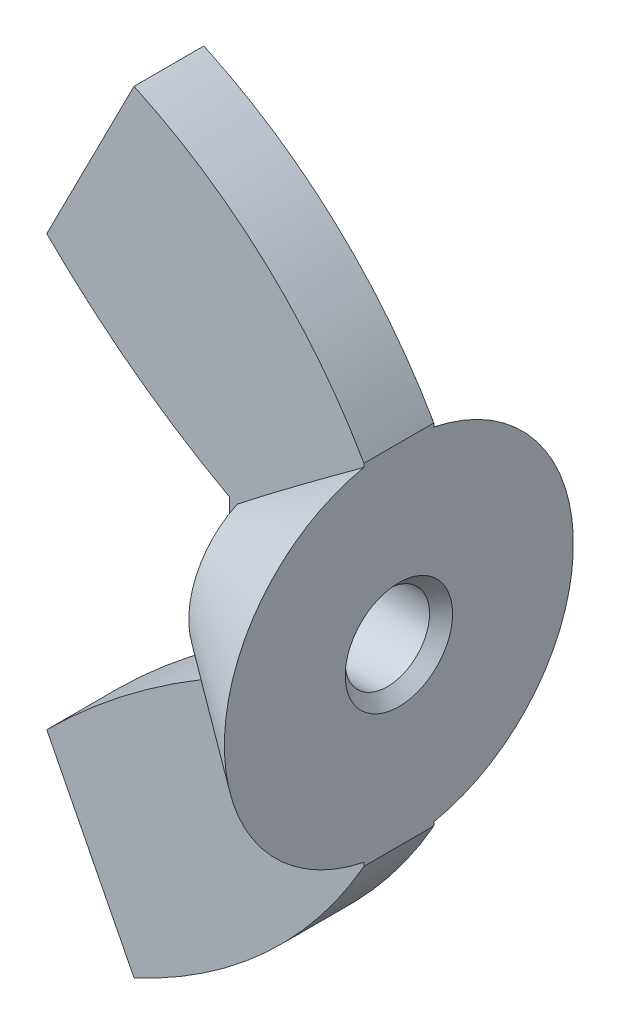
ISO-10303-21;
HEADER;
FILE_DESCRIPTION(('STEP AP214'),'2;1');
FILE_NAME('part.step','',(''),(''),'','','');
FILE_SCHEMA(('AUTOMOTIVE_DESIGN { 1 0 10303 214 1 1 1 1 }'));
ENDSEC;
DATA;
#1=APPLICATION_CONTEXT('core data for automotive mechanical design processes');
#2=APPLICATION_PROTOCOL_DEFINITION('international standard','automotive_design',2000,#1);
#3=PRODUCT_CONTEXT('',#1,'mechanical');
#4=PRODUCT('Part','Part','',(#3));
#5=PRODUCT_RELATED_PRODUCT_CATEGORY('part','',(#4));
#6=PRODUCT_DEFINITION_FORMATION('','',#4);
#7=PRODUCT_DEFINITION_CONTEXT('part definition',#1,'design');
#8=PRODUCT_DEFINITION('design','',#6,#7);
#9=PRODUCT_DEFINITION_SHAPE('','',#8);
#10=(LENGTH_UNIT() NAMED_UNIT(*) SI_UNIT(.MILLI.,.METRE.));
#11=(NAMED_UNIT(*) PLANE_ANGLE_UNIT() SI_UNIT($,.RADIAN.));
#12=(NAMED_UNIT(*) SI_UNIT($,.STERADIAN.) SOLID_ANGLE_UNIT());
#13=UNCERTAINTY_MEASURE_WITH_UNIT(LENGTH_MEASURE(1.E-05),#10,'distance_accuracy_value','');
#14=(GEOMETRIC_REPRESENTATION_CONTEXT(3) GLOBAL_UNCERTAINTY_ASSIGNED_CONTEXT((#13)) GLOBAL_UNIT_ASSIGNED_CONTEXT((#10,
#11,#12)) REPRESENTATION_CONTEXT('',''));
#15=CARTESIAN_POINT('',(0.,0.,0.));
#16=DIRECTION('',(0.,0.,1.));
#17=DIRECTION('',(1.,0.,0.));
#18=AXIS2_PLACEMENT_3D('',#15,#16,#17);
#19=CARTESIAN_POINT('',(0.,0.,0.));
#20=DIRECTION('',(-1.,0.,0.));
#21=DIRECTION('',(0.,0.,1.));
#22=AXIS2_PLACEMENT_3D('',#19,#20,#21);
#23=CONICAL_SURFACE('',#22,2.00000000006639,0.785398163463622);
#24=CARTESIAN_POINT('',(0.,0.,0.));
#25=DIRECTION('',(-1.,0.,0.));
#26=DIRECTION('',(0.,0.,1.));
#27=AXIS2_PLACEMENT_3D('',#24,#25,#26);
#28=CIRCLE('',#27,2.00000000006639);
#29=CARTESIAN_POINT('',(0.,0.,2.00000000006639));
#30=VERTEX_POINT('',#29);
#31=EDGE_CURVE('E18',#30,#30,#28,.T.);
#32=ORIENTED_EDGE('',*,*,#31,.T.);
#33=EDGE_LOOP('',(#32));
#34=FACE_BOUND('',#33,.T.);
#35=CARTESIAN_POINT('',(0.42949999999999,0.,0.));
#36=DIRECTION('',(-1.,0.,0.));
#37=DIRECTION('',(0.,0.,1.));
#38=AXIS2_PLACEMENT_3D('',#35,#36,#37);
#39=CIRCLE('',#38,1.5705);
#40=CARTESIAN_POINT('',(0.42949999999999,0.,1.5705));
#41=VERTEX_POINT('',#40);
#42=EDGE_CURVE('E130',#41,#41,#39,.F.);
#43=ORIENTED_EDGE('',*,*,#42,.T.);
#44=EDGE_LOOP('',(#43));
#45=FACE_BOUND('',#44,.T.);
#46=ADVANCED_FACE('F15',(#34,#45),#23,.F.);
#47=CARTESIAN_POINT('',(14.1996106757234,-28.9913546577898,1.30000000000001));
#48=DIRECTION('',(0.,0.,-1.));
#49=DIRECTION('',(-1.,0.,0.));
#50=AXIS2_PLACEMENT_3D('',#47,#48,#49);
#51=CYLINDRICAL_SURFACE('',#50,29.7019999999998);
#52=DIRECTION('',(0.,0.,-1.));
#53=VECTOR('',#52,1.);
#54=CARTESIAN_POINT('',(0.,-2.90342908564299,100.));
#55=LINE('',#54,#53);
#56=CARTESIAN_POINT('',(0.,-2.90342908564299,1.30000000000001));
#57=VERTEX_POINT('',#56);
#58=CARTESIAN_POINT('',(0.,-2.90342908564299,-1.3));
#59=VERTEX_POINT('',#58);
#60=EDGE_CURVE('E112',#57,#59,#55,.T.);
#61=ORIENTED_EDGE('',*,*,#60,.T.);
#62=CARTESIAN_POINT('',(14.1996106757234,-28.9913546577898,-1.3));
#63=DIRECTION('',(0.,0.,-1.));
#64=DIRECTION('',(-1.,0.,0.));
#65=AXIS2_PLACEMENT_3D('',#62,#63,#64);
#66=CIRCLE('',#65,29.7019999999998);
#67=CARTESIAN_POINT('',(-6.81399999999999,-7.99999999999999,-1.3));
#68=VERTEX_POINT('',#67);
#69=EDGE_CURVE('E115',#59,#68,#66,.F.);
#70=ORIENTED_EDGE('',*,*,#69,.T.);
#71=DIRECTION('',(0.,0.,1.));
#72=VECTOR('',#71,1.);
#73=CARTESIAN_POINT('',(-6.81399999999999,-7.99999999999999,100.));
#74=LINE('',#73,#72);
#75=CARTESIAN_POINT('',(-6.81399999999999,-7.99999999999999,1.30000000000001));
#76=VERTEX_POINT('',#75);
#77=EDGE_CURVE('E118',#68,#76,#74,.T.);
#78=ORIENTED_EDGE('',*,*,#77,.T.);
#79=CARTESIAN_POINT('',(14.1996106757234,-28.9913546577898,1.30000000000001));
#80=DIRECTION('',(0.,0.,-1.));
#81=DIRECTION('',(-1.,0.,0.));
#82=AXIS2_PLACEMENT_3D('',#79,#80,#81);
#83=CIRCLE('',#82,29.7019999999998);
#84=EDGE_CURVE('E224',#76,#57,#83,.T.);
#85=ORIENTED_EDGE('',*,*,#84,.T.);
#86=EDGE_LOOP('',(#61,#70,#78,#85));
#87=FACE_BOUND('',#86,.T.);
#88=ADVANCED_FACE('F117',(#87),#51,.T.);
#89=CARTESIAN_POINT('',(14.1996106757236,28.9913546577898,1.30000000000001));
#90=DIRECTION('',(0.,0.,-1.));
#91=DIRECTION('',(-1.,0.,0.));
#92=AXIS2_PLACEMENT_3D('',#89,#90,#91);
#93=CYLINDRICAL_SURFACE('',#92,29.702);
#94=DIRECTION('',(0.,0.,1.));
#95=VECTOR('',#94,1.);
#96=CARTESIAN_POINT('',(-6.81399999999997,8.00000000000003,100.));
#97=LINE('',#96,#95);
#98=CARTESIAN_POINT('',(-6.81399999999997,8.00000000000003,1.30000000000001));
#99=VERTEX_POINT('',#98);
#100=CARTESIAN_POINT('',(-6.81399999999997,8.00000000000003,-1.3));
#101=VERTEX_POINT('',#100);
#102=EDGE_CURVE('E161',#99,#101,#97,.F.);
#103=ORIENTED_EDGE('',*,*,#102,.T.);
#104=CARTESIAN_POINT('',(14.1996106757236,28.9913546577898,-1.3));
#105=DIRECTION('',(0.,0.,-1.));
#106=DIRECTION('',(-1.,0.,0.));
#107=AXIS2_PLACEMENT_3D('',#104,#105,#106);
#108=CIRCLE('',#107,29.702);
#109=CARTESIAN_POINT('',(0.,2.90342908564298,-1.3));
#110=VERTEX_POINT('',#109);
#111=EDGE_CURVE('E235',#101,#110,#108,.F.);
#112=ORIENTED_EDGE('',*,*,#111,.T.);
#113=DIRECTION('',(0.,0.,-1.));
#114=VECTOR('',#113,1.);
#115=CARTESIAN_POINT('',(0.,2.90342908564298,100.));
#116=LINE('',#115,#114);
#117=CARTESIAN_POINT('',(0.,2.90342908564298,1.30000000000001));
#118=VERTEX_POINT('',#117);
#119=EDGE_CURVE('E165',#110,#118,#116,.F.);
#120=ORIENTED_EDGE('',*,*,#119,.T.);
#121=CARTESIAN_POINT('',(14.1996106757236,28.9913546577898,1.30000000000001));
#122=DIRECTION('',(0.,0.,-1.));
#123=DIRECTION('',(-1.,0.,0.));
#124=AXIS2_PLACEMENT_3D('',#121,#122,#123);
#125=CIRCLE('',#124,29.702);
#126=EDGE_CURVE('E220',#118,#99,#125,.T.);
#127=ORIENTED_EDGE('',*,*,#126,.T.);
#128=EDGE_LOOP('',(#103,#112,#120,#127));
#129=FACE_BOUND('',#128,.T.);
#130=ADVANCED_FACE('F359',(#129),#93,.T.);
#131=CARTESIAN_POINT('',(0.,-2.90342908564299,100.));
#132=DIRECTION('',(1.,0.,0.));
#133=DIRECTION('',(0.,0.,-1.));
#134=AXIS2_PLACEMENT_3D('',#131,#132,#133);
#135=PLANE('',#134);
#136=ORIENTED_EDGE('',*,*,#119,.F.);
#137=DIRECTION('',(0.,-1.,0.));
#138=VECTOR('',#137,1.);
#139=CARTESIAN_POINT('',(0.,26.,-1.3));
#140=LINE('',#139,#138);
#141=CARTESIAN_POINT('',(-1.38550195621923E-11,2.20469436526868,-1.3));
#142=VERTEX_POINT('',#141);
#143=EDGE_CURVE('E234',#110,#142,#140,.T.);
#144=ORIENTED_EDGE('',*,*,#143,.T.);
#145=CARTESIAN_POINT('',(-2.77100391243845E-11,0.,0.));
#146=DIRECTION('',(1.,0.,0.));
#147=DIRECTION('',(0.,0.,-1.));
#148=AXIS2_PLACEMENT_3D('',#145,#146,#147);
#149=CIRCLE('',#148,2.55942908557926);
#150=CARTESIAN_POINT('',(-1.38558869239302E-11,-2.20469436526868,-1.3));
#151=VERTEX_POINT('',#150);
#152=EDGE_CURVE('E164',#151,#142,#149,.T.);
#153=ORIENTED_EDGE('',*,*,#152,.F.);
#154=DIRECTION('',(0.,-1.,0.));
#155=VECTOR('',#154,1.);
#156=CARTESIAN_POINT('',(0.,26.,-1.3));
#157=LINE('',#156,#155);
#158=EDGE_CURVE('E123',#151,#59,#157,.T.);
#159=ORIENTED_EDGE('',*,*,#158,.T.);
#160=ORIENTED_EDGE('',*,*,#60,.F.);
#161=DIRECTION('',(0.,1.,0.));
#162=VECTOR('',#161,1.);
#163=CARTESIAN_POINT('',(0.,-26.,1.3));
#164=LINE('',#163,#162);
#165=CARTESIAN_POINT('',(-1.38558869239302E-11,-2.20469436526867,1.3));
#166=VERTEX_POINT('',#165);
#167=EDGE_CURVE('E226',#57,#166,#164,.T.);
#168=ORIENTED_EDGE('',*,*,#167,.T.);
#169=CARTESIAN_POINT('',(-2.77100391243845E-11,0.,0.));
#170=DIRECTION('',(1.,0.,0.));
#171=DIRECTION('',(0.,0.,-1.));
#172=AXIS2_PLACEMENT_3D('',#169,#170,#171);
#173=CIRCLE('',#172,2.55942908557926);
#174=CARTESIAN_POINT('',(-1.38550195621923E-11,2.20469436526868,1.3));
#175=VERTEX_POINT('',#174);
#176=EDGE_CURVE('E160',#175,#166,#173,.T.);
#177=ORIENTED_EDGE('',*,*,#176,.F.);
#178=DIRECTION('',(0.,1.,0.));
#179=VECTOR('',#178,1.);
#180=CARTESIAN_POINT('',(0.,-26.,1.3));
#181=LINE('',#180,#179);
#182=EDGE_CURVE('E223',#175,#118,#181,.T.);
#183=ORIENTED_EDGE('',*,*,#182,.T.);
#184=EDGE_LOOP('',(#136,#144,#153,#159,#160,#168,#177,#183));
#185=FACE_BOUND('',#184,.T.);
#186=ORIENTED_EDGE('',*,*,#31,.F.);
#187=EDGE_LOOP('',(#186));
#188=FACE_BOUND('',#187,.T.);
#189=ADVANCED_FACE('F334',(#185,#188),#135,.F.);
#190=CARTESIAN_POINT('',(2.5,0.,0.));
#191=DIRECTION('',(-1.,0.,0.));
#192=DIRECTION('',(0.,0.,1.));
#193=AXIS2_PLACEMENT_3D('',#190,#191,#192);
#194=CYLINDRICAL_SURFACE('',#193,1.5705);
#195=ORIENTED_EDGE('',*,*,#42,.F.);
#196=EDGE_LOOP('',(#195));
#197=FACE_BOUND('',#196,.T.);
#198=CARTESIAN_POINT('',(4.57050000005665,0.,0.));
#199=DIRECTION('',(1.,0.,0.));
#200=DIRECTION('',(0.,1.,0.));
#201=AXIS2_PLACEMENT_3D('',#198,#199,#200);
#202=CIRCLE('',#201,1.57050000001391);
#203=CARTESIAN_POINT('',(4.57050000005665,1.57050000001391,0.));
#204=VERTEX_POINT('',#203);
#205=EDGE_CURVE('E157',#204,#204,#202,.T.);
#206=ORIENTED_EDGE('',*,*,#205,.T.);
#207=EDGE_LOOP('',(#206));
#208=FACE_BOUND('',#207,.T.);
#209=ADVANCED_FACE('F353',(#197,#208),#194,.F.);
#210=CARTESIAN_POINT('',(-3.56433600286434,-14.3778247001403,100.));
#211=DIRECTION('',(0.891006524188369,0.453990499739545,0.));
#212=DIRECTION('',(-0.453990499739545,0.891006524188369,0.));
#213=AXIS2_PLACEMENT_3D('',#210,#211,#212);
#214=PLANE('',#213);
#215=ORIENTED_EDGE('',*,*,#77,.F.);
#216=DIRECTION('',(0.453990499739545,-0.891006524188369,0.));
#217=VECTOR('',#216,1.);
#218=CARTESIAN_POINT('',(-6.81399999999999,-7.99999999999999,-1.3));
#219=LINE('',#218,#217);
#220=CARTESIAN_POINT('',(-3.56433600286433,-14.3778247001403,-1.3));
#221=VERTEX_POINT('',#220);
#222=EDGE_CURVE('E122',#68,#221,#219,.T.);
#223=ORIENTED_EDGE('',*,*,#222,.T.);
#224=DIRECTION('',(0.,0.,-1.));
#225=VECTOR('',#224,1.);
#226=CARTESIAN_POINT('',(-3.56433600286433,-14.3778247001403,100.));
#227=LINE('',#226,#225);
#228=CARTESIAN_POINT('',(-3.56433600286433,-14.3778247001403,1.30000000000001));
#229=VERTEX_POINT('',#228);
#230=EDGE_CURVE('E149',#221,#229,#227,.F.);
#231=ORIENTED_EDGE('',*,*,#230,.T.);
#232=DIRECTION('',(-0.453990499739545,0.891006524188369,0.));
#233=VECTOR('',#232,1.);
#234=CARTESIAN_POINT('',(-3.56433600286434,-14.3778247001403,1.3));
#235=LINE('',#234,#233);
#236=EDGE_CURVE('E128',#229,#76,#235,.T.);
#237=ORIENTED_EDGE('',*,*,#236,.T.);
#238=EDGE_LOOP('',(#215,#223,#231,#237));
#239=FACE_BOUND('',#238,.T.);
#240=ADVANCED_FACE('F125',(#239),#214,.F.);
#241=CARTESIAN_POINT('',(13.,26.,-1.3));
#242=DIRECTION('',(0.,0.,1.));
#243=DIRECTION('',(0.,-1.,0.));
#244=AXIS2_PLACEMENT_3D('',#241,#242,#243);
#245=PLANE('',#244);
#246=CARTESIAN_POINT('',(5.00000000002686,-6.36867333123476,-1.3));
#247=CARTESIAN_POINT('',(4.8016150496542,-6.2230240439862,-1.3));
#248=CARTESIAN_POINT('',(4.60332023135893,-6.07725172615405,-1.3));
#249=CARTESIAN_POINT('',(4.20696679997771,-5.78538467004323,-1.3));
#250=CARTESIAN_POINT('',(4.00890818786176,-5.63928993044749,-1.3));
#251=CARTESIAN_POINT('',(3.61309737613245,-5.34671220686773,-1.3));
#252=CARTESIAN_POINT('',(3.4153451577552,-5.2002292482787,-1.3));
#253=CARTESIAN_POINT('',(3.02021817370736,-4.90675560080711,-1.3));
#254=CARTESIAN_POINT('',(2.82284340742597,-4.75976491274723,-1.3));
#255=CARTESIAN_POINT('',(2.42857389670943,-4.46511274929436,-1.3));
#256=CARTESIAN_POINT('',(2.23167918586487,-4.31745122892073,-1.3));
#257=CARTESIAN_POINT('',(1.83855678775455,-4.02124633974177,-1.3));
#258=CARTESIAN_POINT('',(1.6423290939681,-3.87270297959642,-1.3));
#259=CARTESIAN_POINT('',(1.250784438313,-3.57439143088383,-1.3));
#260=CARTESIAN_POINT('',(1.05546753740558,-3.42462316212733,-1.3));
#261=CARTESIAN_POINT('',(0.763503223122361,-3.19865716122437,-1.3));
#262=CARTESIAN_POINT('',(0.666348705311224,-3.12311497762522,-1.3));
#263=CARTESIAN_POINT('',(0.472463671180506,-2.97148660154289,-1.3));
#264=CARTESIAN_POINT('',(0.375733159226848,-2.89540040347921,-1.3));
#265=CARTESIAN_POINT('',(0.27925860072703,-2.81898950344029,-1.3));
#266=B_SPLINE_CURVE_WITH_KNOTS('',3,(#246,#247,#248,#249,#250,#251,#252,#253,#254,#255,#256,
#257,#258,#259,#260,#261,#262,#263,#264,#265),.UNSPECIFIED.,.F.,.F.,(4,2,2,2,2,2,2,2,2,4),(0.,
0.738331230415682,1.47666548246948,2.21495257376638,2.95323846937603,3.69157462150384,
4.42990353486453,5.16828117649317,5.53748211381658,5.90668684385705),.UNSPECIFIED.);
#267=CARTESIAN_POINT('',(5.00000000002616,-6.36867333123424,-1.3));
#268=VERTEX_POINT('',#267);
#269=CARTESIAN_POINT('',(0.27925860069519,-2.81898950345571,-1.3));
#270=VERTEX_POINT('',#269);
#271=EDGE_CURVE('E148',#268,#270,#266,.T.);
#272=ORIENTED_EDGE('',*,*,#271,.F.);
#273=DIRECTION('',(0.,-1.,0.));
#274=VECTOR('',#273,1.);
#275=CARTESIAN_POINT('',(5.00000000000003,26.,-1.3));
#276=LINE('',#275,#274);
#277=CARTESIAN_POINT('',(5.00000000000002,-6.49999999999997,-1.3));
#278=VERTEX_POINT('',#277);
#279=EDGE_CURVE('E137',#278,#268,#276,.F.);
#280=ORIENTED_EDGE('',*,*,#279,.F.);
#281=CARTESIAN_POINT('',(-11.5128748211745,2.85763672837432,-1.3));
#282=DIRECTION('',(0.,0.,-1.));
#283=DIRECTION('',(-1.,0.,0.));
#284=AXIS2_PLACEMENT_3D('',#281,#282,#283);
#285=CIRCLE('',#284,18.98);
#286=EDGE_CURVE('E135',#278,#221,#285,.T.);
#287=ORIENTED_EDGE('',*,*,#286,.T.);
#288=ORIENTED_EDGE('',*,*,#222,.F.);
#289=ORIENTED_EDGE('',*,*,#69,.F.);
#290=ORIENTED_EDGE('',*,*,#158,.F.);
#291=CARTESIAN_POINT('',(0.279258600691384,-2.81898950347578,-1.3));
#292=CARTESIAN_POINT('',(0.25553145420692,-2.76800636012062,-1.3));
#293=CARTESIAN_POINT('',(0.231895228846491,-2.71698074806109,-1.3));
#294=CARTESIAN_POINT('',(0.184838156431872,-2.61483183239367,-1.3));
#295=CARTESIAN_POINT('',(0.161417304175548,-2.56370853118157,-1.3));
#296=CARTESIAN_POINT('',(0.114823210817285,-2.4613486837898,-1.3));
#297=CARTESIAN_POINT('',(0.0916499713188506,-2.41011213687937,-1.3));
#298=CARTESIAN_POINT('',(0.0455950642403069,-2.30750672404795,-1.3));
#299=CARTESIAN_POINT('',(0.0227134037479751,-2.25613785494679,-1.3));
#300=CARTESIAN_POINT('',(-5.7722380581833E-12,-2.20469436528699,-1.3));
#301=B_SPLINE_CURVE_WITH_KNOTS('',3,(#291,#292,#293,#294,#295,#296,#297,#298,#299,#300),
.UNSPECIFIED.,.F.,.F.,(4,2,2,2,4),(0.,0.168701993332963,0.337399901068614,0.506098900605599,
0.674801993128298),.UNSPECIFIED.);
#302=EDGE_CURVE('E139',#270,#151,#301,.T.);
#303=ORIENTED_EDGE('',*,*,#302,.F.);
#304=EDGE_LOOP('',(#272,#280,#287,#288,#289,#290,#303));
#305=FACE_BOUND('',#304,.T.);
#306=ADVANCED_FACE('F133',(#305),#245,.F.);
#307=CARTESIAN_POINT('',(0.279258600585308,0.,0.));
#308=DIRECTION('',(1.,0.,0.));
#309=DIRECTION('',(0.,0.,-1.));
#310=AXIS2_PLACEMENT_3D('',#307,#308,#309);
#311=CONICAL_SURFACE('',#310,3.10430375759551,1.09718378099983);
#312=ORIENTED_EDGE('',*,*,#302,.T.);
#313=ORIENTED_EDGE('',*,*,#152,.T.);
#314=CARTESIAN_POINT('',(-8.22496910306182E-13,2.2046943652982,-1.3));
#315=CARTESIAN_POINT('',(0.0227134037529318,2.25613785495795,-1.3));
#316=CARTESIAN_POINT('',(0.0455950642452682,2.30750672405906,-1.3));
#317=CARTESIAN_POINT('',(0.0916499713238175,2.41011213689038,-1.3));
#318=CARTESIAN_POINT('',(0.114823210822253,2.46134868380076,-1.3));
#319=CARTESIAN_POINT('',(0.161417304180514,2.56370853119243,-1.3));
#320=CARTESIAN_POINT('',(0.184838156436837,2.61483183240448,-1.3));
#321=CARTESIAN_POINT('',(0.231895228851449,2.71698074807182,-1.3));
#322=CARTESIAN_POINT('',(0.255531454211872,2.76800636013129,-1.3));
#323=CARTESIAN_POINT('',(0.27925860069633,2.81898950348641,-1.3));
#324=B_SPLINE_CURVE_WITH_KNOTS('',3,(#314,#315,#316,#317,#318,#319,#320,#321,#322,#323),
.UNSPECIFIED.,.F.,.F.,(4,2,2,2,4),(0.,0.168703092522565,0.337402092059417,0.506099999794936,
0.674801993127765),.UNSPECIFIED.);
#325=CARTESIAN_POINT('',(0.279258600716023,2.81898950346679,-1.3));
#326=VERTEX_POINT('',#325);
#327=EDGE_CURVE('E227',#142,#326,#324,.T.);
#328=ORIENTED_EDGE('',*,*,#327,.T.);
#329=CARTESIAN_POINT('',(0.279258600698995,0.,0.));
#330=DIRECTION('',(1.,0.,0.));
#331=DIRECTION('',(0.,0.,-1.));
#332=AXIS2_PLACEMENT_3D('',#329,#330,#331);
#333=CIRCLE('',#332,3.10430375776604);
#334=EDGE_CURVE('E144',#270,#326,#333,.T.);
#335=ORIENTED_EDGE('',*,*,#334,.F.);
#336=EDGE_LOOP('',(#312,#313,#328,#335));
#337=FACE_BOUND('',#336,.T.);
#338=ADVANCED_FACE('F237',(#337),#311,.T.);
#339=CARTESIAN_POINT('',(-6.81399999999997,8.00000000000003,100.));
#340=DIRECTION('',(0.891006524188368,-0.453990499739547,0.));
#341=DIRECTION('',(0.453990499739547,0.891006524188368,0.));
#342=AXIS2_PLACEMENT_3D('',#339,#340,#341);
#343=PLANE('',#342);
#344=DIRECTION('',(0.,0.,-1.));
#345=VECTOR('',#344,1.);
#346=CARTESIAN_POINT('',(-3.56433600286433,14.3778247001403,100.));
#347=LINE('',#346,#345);
#348=CARTESIAN_POINT('',(-3.56433600286433,14.3778247001403,1.3));
#349=VERTEX_POINT('',#348);
#350=CARTESIAN_POINT('',(-3.56433600286433,14.3778247001403,-1.3));
#351=VERTEX_POINT('',#350);
#352=EDGE_CURVE('E147',#349,#351,#347,.T.);
#353=ORIENTED_EDGE('',*,*,#352,.T.);
#354=DIRECTION('',(-0.453990499739545,-0.891006524188369,0.));
#355=VECTOR('',#354,1.);
#356=CARTESIAN_POINT('',(-3.56433600286432,14.3778247001403,-1.3));
#357=LINE('',#356,#355);
#358=EDGE_CURVE('E314',#351,#101,#357,.T.);
#359=ORIENTED_EDGE('',*,*,#358,.T.);
#360=ORIENTED_EDGE('',*,*,#102,.F.);
#361=DIRECTION('',(0.453990499739545,0.891006524188369,0.));
#362=VECTOR('',#361,1.);
#363=CARTESIAN_POINT('',(-6.81399999999997,8.00000000000003,1.3));
#364=LINE('',#363,#362);
#365=EDGE_CURVE('E222',#99,#349,#364,.T.);
#366=ORIENTED_EDGE('',*,*,#365,.T.);
#367=EDGE_LOOP('',(#353,#359,#360,#366));
#368=FACE_BOUND('',#367,.T.);
#369=ADVANCED_FACE('F244',(#368),#343,.F.);
#370=CARTESIAN_POINT('',(13.,26.,-1.3));
#371=DIRECTION('',(0.,0.,1.));
#372=DIRECTION('',(0.,-1.,0.));
#373=AXIS2_PLACEMENT_3D('',#370,#371,#372);
#374=PLANE('',#373);
#375=ORIENTED_EDGE('',*,*,#143,.F.);
#376=ORIENTED_EDGE('',*,*,#111,.F.);
#377=ORIENTED_EDGE('',*,*,#358,.F.);
#378=CARTESIAN_POINT('',(-11.5128748211745,-2.85763672837426,-1.3));
#379=DIRECTION('',(0.,0.,-1.));
#380=DIRECTION('',(-1.,0.,0.));
#381=AXIS2_PLACEMENT_3D('',#378,#379,#380);
#382=CIRCLE('',#381,18.98);
#383=CARTESIAN_POINT('',(5.,6.49999999999998,-1.3));
#384=VERTEX_POINT('',#383);
#385=EDGE_CURVE('E312',#351,#384,#382,.T.);
#386=ORIENTED_EDGE('',*,*,#385,.T.);
#387=DIRECTION('',(0.,-1.,0.));
#388=VECTOR('',#387,1.);
#389=CARTESIAN_POINT('',(5.00000000000001,26.,-1.3));
#390=LINE('',#389,#388);
#391=CARTESIAN_POINT('',(5.00000000002615,6.36867333123424,-1.3));
#392=VERTEX_POINT('',#391);
#393=EDGE_CURVE('E163',#392,#384,#390,.F.);
#394=ORIENTED_EDGE('',*,*,#393,.F.);
#395=CARTESIAN_POINT('',(0.279258600730206,2.81898950345412,-1.30000000001264));
#396=CARTESIAN_POINT('',(0.407338585316819,2.9204173066524,-1.30000000000454));
#397=CARTESIAN_POINT('',(0.535857534559914,3.02128713845416,-1.30000000000122));
#398=CARTESIAN_POINT('',(0.79359367234952,3.22212660996596,-1.29999999999878));
#399=CARTESIAN_POINT('',(0.922810848572027,3.32209626548199,-1.29999999999967));
#400=CARTESIAN_POINT('',(1.18176253868436,3.52135027906163,-1.30000000000033));
#401=CARTESIAN_POINT('',(1.31149702942352,3.6206346672609,-1.30000000000009));
#402=CARTESIAN_POINT('',(1.57138052078364,3.8186605750998,-1.29999999999991));
#403=CARTESIAN_POINT('',(1.70152952350795,3.91740209197782,-1.29999999999997));
#404=CARTESIAN_POINT('',(2.0924463898673,4.21296397371308,-1.30000000000006));
#405=CARTESIAN_POINT('',(2.35370374933099,4.40913672272329,-1.30000000000002));
#406=CARTESIAN_POINT('',(2.87708680666252,4.80032482674322,-1.29999999999998));
#407=CARTESIAN_POINT('',(3.13921251465623,4.9953401681818,-1.3));
#408=CARTESIAN_POINT('',(3.53458034045193,5.28851830622555,-1.3));
#409=CARTESIAN_POINT('',(3.66759472188264,5.38698843822984,-1.3));
#410=CARTESIAN_POINT('',(3.93375731802859,5.58374637661456,-1.3));
#411=CARTESIAN_POINT('',(4.06690553212147,5.68203418383685,-1.3));
#412=CARTESIAN_POINT('',(4.33332103769017,5.87845755466677,-1.3));
#413=CARTESIAN_POINT('',(4.46658833298773,5.9765931130898,-1.3));
#414=CARTESIAN_POINT('',(4.733223022649,6.17272939386383,-1.3));
#415=CARTESIAN_POINT('',(4.86659041745271,6.27073011561672,-1.3));
#416=CARTESIAN_POINT('',(5.00000000002686,6.36867333123476,-1.3));
#417=B_SPLINE_CURVE_WITH_KNOTS('',3,(#395,#396,#397,#398,#399,#400,#401,#402,#403,#404,#405,
#406,#407,#408,#409,#410,#411,#412,#413,#414,#415,#416),.UNSPECIFIED.,.F.,.F.,(4,2,2,2,2,2,2,2,
2,2,4),(0.,0.49012654029381,0.980244457720744,1.47034068236273,1.96043939785614,
2.94056260066677,3.9206972732644,4.41718755352936,4.91367553557207,5.41018006915151,
5.90668679807371),.UNSPECIFIED.);
#418=EDGE_CURVE('E248',#326,#392,#417,.T.);
#419=ORIENTED_EDGE('',*,*,#418,.F.);
#420=ORIENTED_EDGE('',*,*,#327,.F.);
#421=EDGE_LOOP('',(#375,#376,#377,#386,#394,#419,#420));
#422=FACE_BOUND('',#421,.T.);
#423=ADVANCED_FACE('F241',(#422),#374,.F.);
#424=CARTESIAN_POINT('',(13.,-26.,1.3));
#425=DIRECTION('',(0.,0.,-1.));
#426=DIRECTION('',(0.,1.,0.));
#427=AXIS2_PLACEMENT_3D('',#424,#425,#426);
#428=PLANE('',#427);
#429=ORIENTED_EDGE('',*,*,#167,.F.);
#430=ORIENTED_EDGE('',*,*,#84,.F.);
#431=ORIENTED_EDGE('',*,*,#236,.F.);
#432=CARTESIAN_POINT('',(-11.5128748211745,2.85763672837432,1.30000000000001));
#433=DIRECTION('',(0.,0.,-1.));
#434=DIRECTION('',(-1.,0.,0.));
#435=AXIS2_PLACEMENT_3D('',#432,#433,#434);
#436=CIRCLE('',#435,18.98);
#437=CARTESIAN_POINT('',(5.00000000000001,-6.49999999999999,1.30000000000001));
#438=VERTEX_POINT('',#437);
#439=EDGE_CURVE('E151',#229,#438,#436,.F.);
#440=ORIENTED_EDGE('',*,*,#439,.T.);
#441=DIRECTION('',(0.,1.,0.));
#442=VECTOR('',#441,1.);
#443=CARTESIAN_POINT('',(5.00000000000001,-26.,1.3));
#444=LINE('',#443,#442);
#445=CARTESIAN_POINT('',(5.00000000002615,-6.36867333123423,1.3));
#446=VERTEX_POINT('',#445);
#447=EDGE_CURVE('E233',#446,#438,#444,.F.);
#448=ORIENTED_EDGE('',*,*,#447,.F.);
#449=CARTESIAN_POINT('',(0.279258600723958,-2.81898950344446,1.30000000000739));
#450=CARTESIAN_POINT('',(0.407338585308911,-2.92041730664449,1.30000000000266));
#451=CARTESIAN_POINT('',(0.535857534551209,-3.02128713844689,1.30000000000071));
#452=CARTESIAN_POINT('',(0.793593672339979,-3.222126609959,1.29999999999929));
#453=CARTESIAN_POINT('',(0.922810848562446,-3.32209626547471,1.29999999999981));
#454=CARTESIAN_POINT('',(1.1817625386745,-3.52135027905394,1.30000000000019));
#455=CARTESIAN_POINT('',(1.31149702941341,-3.62063466725313,1.30000000000005));
#456=CARTESIAN_POINT('',(1.5713805207731,-3.81866057509182,1.29999999999995));
#457=CARTESIAN_POINT('',(1.70152952349722,-3.9174020919697,1.29999999999998));
#458=CARTESIAN_POINT('',(2.09244638985599,-4.21296397370454,1.30000000000004));
#459=CARTESIAN_POINT('',(2.35370374931927,-4.40913672271449,1.30000000000001));
#460=CARTESIAN_POINT('',(2.87708680665,-4.80032482673388,1.29999999999999));
#461=CARTESIAN_POINT('',(3.13921251464331,-4.99534016817219,1.3));
#462=CARTESIAN_POINT('',(3.53458034043971,-5.28851830621651,1.3));
#463=CARTESIAN_POINT('',(3.66759472187153,-5.38698843822162,1.3));
#464=CARTESIAN_POINT('',(3.93375731801969,-5.58374637660799,1.3));
#465=CARTESIAN_POINT('',(4.06690553211368,-5.6820341838311,1.3));
#466=CARTESIAN_POINT('',(4.3333210376846,-5.87845755466267,1.3));
#467=CARTESIAN_POINT('',(4.46658833298327,-5.97659311308652,1.3));
#468=CARTESIAN_POINT('',(4.73322302264677,-6.17272939386219,1.3));
#469=CARTESIAN_POINT('',(4.86659041745159,-6.2707301156159,1.3));
#470=CARTESIAN_POINT('',(5.00000000002686,-6.36867333123476,1.3));
#471=B_SPLINE_CURVE_WITH_KNOTS('',3,(#449,#450,#451,#452,#453,#454,#455,#456,#457,#458,#459,
#460,#461,#462,#463,#464,#465,#466,#467,#468,#469,#470),.UNSPECIFIED.,.F.,.F.,(4,2,2,2,2,2,2,2,
2,2,4),(0.,0.490126540293121,0.980244457719353,1.47034068236062,1.96043939785332,
2.94056260066251,3.92069727325869,4.4171875535278,4.91367553557465,5.41018006915824,
5.90668679808458),.UNSPECIFIED.);
#472=CARTESIAN_POINT('',(0.279258600709281,-2.81898950345808,1.3));
#473=VERTEX_POINT('',#472);
#474=EDGE_CURVE('E183',#473,#446,#471,.T.);
#475=ORIENTED_EDGE('',*,*,#474,.F.);
#476=CARTESIAN_POINT('',(-2.0714840578231E-12,-2.20469436528526,1.29999999999483));
#477=CARTESIAN_POINT('',(0.0227134037492977,-2.25613785494612,1.29999999999813));
#478=CARTESIAN_POINT('',(0.0455950642406497,-2.30750672404774,1.2999999999995));
#479=CARTESIAN_POINT('',(0.0916499713184754,-2.4101121368795,1.3000000000005));
#480=CARTESIAN_POINT('',(0.114823210817172,-2.46134868378982,1.30000000000014));
#481=CARTESIAN_POINT('',(0.161417304175645,-2.5637085311815,1.29999999999986));
#482=CARTESIAN_POINT('',(0.184838156431918,-2.61483183239362,1.29999999999993));
#483=CARTESIAN_POINT('',(0.231895228846436,-2.7169807480611,1.30000000000007));
#484=CARTESIAN_POINT('',(0.255531454206814,-2.76800636012065,1.30000000000014));
#485=CARTESIAN_POINT('',(0.279258600691384,-2.81898950347577,1.3));
#486=B_SPLINE_CURVE_WITH_KNOTS('',3,(#476,#477,#478,#479,#480,#481,#482,#483,#484,#485),
.UNSPECIFIED.,.F.,.F.,(4,2,2,2,4),(0.,0.168703092522731,0.337402092059735,0.506099999795391,
0.674801993128368),.UNSPECIFIED.);
#487=EDGE_CURVE('E213',#166,#473,#486,.T.);
#488=ORIENTED_EDGE('',*,*,#487,.F.);
#489=EDGE_LOOP('',(#429,#430,#431,#440,#448,#475,#488));
#490=FACE_BOUND('',#489,.T.);
#491=ADVANCED_FACE('F198',(#490),#428,.F.);
#492=CARTESIAN_POINT('',(13.,-26.,1.3));
#493=DIRECTION('',(0.,0.,-1.));
#494=DIRECTION('',(0.,1.,0.));
#495=AXIS2_PLACEMENT_3D('',#492,#493,#494);
#496=PLANE('',#495);
#497=CARTESIAN_POINT('',(5.00000000002686,6.36867333123476,1.3));
#498=CARTESIAN_POINT('',(4.8016150496542,6.2230240439862,1.3));
#499=CARTESIAN_POINT('',(4.60332023135893,6.07725172615404,1.3));
#500=CARTESIAN_POINT('',(4.20696679997771,5.78538467004322,1.3));
#501=CARTESIAN_POINT('',(4.00890818786176,5.63928993044749,1.3));
#502=CARTESIAN_POINT('',(3.61309737613245,5.34671220686772,1.3));
#503=CARTESIAN_POINT('',(3.4153451577552,5.20022924827869,1.3));
#504=CARTESIAN_POINT('',(3.02021817370735,4.9067556008071,1.3));
#505=CARTESIAN_POINT('',(2.82284340742597,4.75976491274722,1.3));
#506=CARTESIAN_POINT('',(2.42857389670943,4.46511274929435,1.3));
#507=CARTESIAN_POINT('',(2.23167918586487,4.31745122892072,1.3));
#508=CARTESIAN_POINT('',(1.83855678775455,4.02124633974176,1.3));
#509=CARTESIAN_POINT('',(1.6423290939681,3.87270297959641,1.3));
#510=CARTESIAN_POINT('',(1.250784438313,3.57439143088382,1.3));
#511=CARTESIAN_POINT('',(1.05546753740558,3.42462316212732,1.3));
#512=CARTESIAN_POINT('',(0.76350322312236,3.19865716122437,1.3));
#513=CARTESIAN_POINT('',(0.666348705311223,3.12311497762522,1.3));
#514=CARTESIAN_POINT('',(0.472463671180505,2.97148660154289,1.3));
#515=CARTESIAN_POINT('',(0.375733159226847,2.8954004034792,1.3));
#516=CARTESIAN_POINT('',(0.27925860072703,2.81898950344028,1.3));
#517=B_SPLINE_CURVE_WITH_KNOTS('',3,(#497,#498,#499,#500,#501,#502,#503,#504,#505,#506,#507,
#508,#509,#510,#511,#512,#513,#514,#515,#516),.UNSPECIFIED.,.F.,.F.,(4,2,2,2,2,2,2,2,2,4),(0.,
0.738331230415682,1.47666548246948,2.21495257376638,2.95323846937604,3.69157462150384,
4.42990353486453,5.16828117649317,5.53748211381658,5.90668684385705),.UNSPECIFIED.);
#518=CARTESIAN_POINT('',(5.00000000002615,6.36867333123423,1.3));
#519=VERTEX_POINT('',#518);
#520=CARTESIAN_POINT('',(0.279258600695189,2.81898950345571,1.3));
#521=VERTEX_POINT('',#520);
#522=EDGE_CURVE('E175',#519,#521,#517,.T.);
#523=ORIENTED_EDGE('',*,*,#522,.F.);
#524=DIRECTION('',(0.,1.,0.));
#525=VECTOR('',#524,1.);
#526=CARTESIAN_POINT('',(5.,-26.,1.3));
#527=LINE('',#526,#525);
#528=CARTESIAN_POINT('',(5.,6.49999999999999,1.3));
#529=VERTEX_POINT('',#528);
#530=EDGE_CURVE('E32',#529,#519,#527,.F.);
#531=ORIENTED_EDGE('',*,*,#530,.F.);
#532=CARTESIAN_POINT('',(-11.5128748211745,-2.85763672837426,1.3));
#533=DIRECTION('',(0.,0.,-1.));
#534=DIRECTION('',(-1.,0.,0.));
#535=AXIS2_PLACEMENT_3D('',#532,#533,#534);
#536=CIRCLE('',#535,18.98);
#537=EDGE_CURVE('E325',#529,#349,#536,.F.);
#538=ORIENTED_EDGE('',*,*,#537,.T.);
#539=ORIENTED_EDGE('',*,*,#365,.F.);
#540=ORIENTED_EDGE('',*,*,#126,.F.);
#541=ORIENTED_EDGE('',*,*,#182,.F.);
#542=CARTESIAN_POINT('',(0.279258600691384,2.81898950347577,1.3));
#543=CARTESIAN_POINT('',(0.25553145420692,2.76800636012061,1.3));
#544=CARTESIAN_POINT('',(0.231895228846491,2.71698074806109,1.3));
#545=CARTESIAN_POINT('',(0.184838156431872,2.61483183239366,1.3));
#546=CARTESIAN_POINT('',(0.161417304175547,2.56370853118156,1.3));
#547=CARTESIAN_POINT('',(0.114823210817285,2.4613486837898,1.3));
#548=CARTESIAN_POINT('',(0.0916499713188502,2.41011213687937,1.3));
#549=CARTESIAN_POINT('',(0.0455950642403067,2.30750672404794,1.3));
#550=CARTESIAN_POINT('',(0.0227134037479749,2.25613785494678,1.3));
#551=CARTESIAN_POINT('',(-5.77267732683828E-12,2.20469436528698,1.3));
#552=B_SPLINE_CURVE_WITH_KNOTS('',3,(#542,#543,#544,#545,#546,#547,#548,#549,#550,#551),
.UNSPECIFIED.,.F.,.F.,(4,2,2,2,4),(0.,0.168701993332963,0.337399901068615,0.5060989006056,
0.674801993128299),.UNSPECIFIED.);
#553=EDGE_CURVE('E206',#521,#175,#552,.T.);
#554=ORIENTED_EDGE('',*,*,#553,.F.);
#555=EDGE_LOOP('',(#523,#531,#538,#539,#540,#541,#554));
#556=FACE_BOUND('',#555,.T.);
#557=ADVANCED_FACE('F193',(#556),#496,.F.);
#558=CARTESIAN_POINT('',(0.279258600585308,0.,0.));
#559=DIRECTION('',(1.,0.,0.));
#560=DIRECTION('',(0.,0.,-1.));
#561=AXIS2_PLACEMENT_3D('',#558,#559,#560);
#562=CONICAL_SURFACE('',#561,3.10430375759551,1.09718378099983);
#563=ORIENTED_EDGE('',*,*,#553,.T.);
#564=ORIENTED_EDGE('',*,*,#176,.T.);
#565=ORIENTED_EDGE('',*,*,#487,.T.);
#566=CARTESIAN_POINT('',(0.279258600698995,0.,0.));
#567=DIRECTION('',(1.,0.,0.));
#568=DIRECTION('',(0.,0.,-1.));
#569=AXIS2_PLACEMENT_3D('',#566,#567,#568);
#570=CIRCLE('',#569,3.10430375776604);
#571=EDGE_CURVE('E174',#521,#473,#570,.T.);
#572=ORIENTED_EDGE('',*,*,#571,.F.);
#573=EDGE_LOOP('',(#563,#564,#565,#572));
#574=FACE_BOUND('',#573,.T.);
#575=ADVANCED_FACE('F197',(#574),#562,.T.);
#576=CARTESIAN_POINT('',(4.99999999999545,0.,0.));
#577=DIRECTION('',(1.,0.,0.));
#578=DIRECTION('',(0.,0.,-1.));
#579=AXIS2_PLACEMENT_3D('',#576,#577,#578);
#580=CONICAL_SURFACE('',#579,2.00000000000955,0.785398163463622);
#581=ORIENTED_EDGE('',*,*,#205,.F.);
#582=EDGE_LOOP('',(#581));
#583=FACE_BOUND('',#582,.T.);
#584=CARTESIAN_POINT('',(4.99999999999545,0.,0.));
#585=DIRECTION('',(1.,0.,0.));
#586=DIRECTION('',(0.,0.,-1.));
#587=AXIS2_PLACEMENT_3D('',#584,#585,#586);
#588=CIRCLE('',#587,2.00000000000955);
#589=CARTESIAN_POINT('',(4.99999999999545,0.,-2.00000000000955));
#590=VERTEX_POINT('',#589);
#591=EDGE_CURVE('E156',#590,#590,#588,.F.);
#592=ORIENTED_EDGE('',*,*,#591,.F.);
#593=EDGE_LOOP('',(#592));
#594=FACE_BOUND('',#593,.T.);
#595=ADVANCED_FACE('F269',(#583,#594),#580,.F.);
#596=CARTESIAN_POINT('',(-11.5128748211745,2.85763672837432,1.30000000000001));
#597=DIRECTION('',(0.,0.,-1.));
#598=DIRECTION('',(-1.,0.,0.));
#599=AXIS2_PLACEMENT_3D('',#596,#597,#598);
#600=CYLINDRICAL_SURFACE('',#599,18.98);
#601=ORIENTED_EDGE('',*,*,#230,.F.);
#602=ORIENTED_EDGE('',*,*,#286,.F.);
#603=DIRECTION('',(0.,0.,-1.));
#604=VECTOR('',#603,1.);
#605=CARTESIAN_POINT('',(5.,-6.49999999999997,0.));
#606=LINE('',#605,#604);
#607=EDGE_CURVE('E152',#438,#278,#606,.T.);
#608=ORIENTED_EDGE('',*,*,#607,.F.);
#609=ORIENTED_EDGE('',*,*,#439,.F.);
#610=EDGE_LOOP('',(#601,#602,#608,#609));
#611=FACE_BOUND('',#610,.T.);
#612=ADVANCED_FACE('F265',(#611),#600,.T.);
#613=CARTESIAN_POINT('',(5.0000000000523,0.,0.));
#614=DIRECTION('',(1.,0.,0.));
#615=DIRECTION('',(0.,0.,-1.));
#616=AXIS2_PLACEMENT_3D('',#613,#614,#615);
#617=CONICAL_SURFACE('',#616,6.50000000001682,0.623571235158636);
#618=ORIENTED_EDGE('',*,*,#271,.T.);
#619=ORIENTED_EDGE('',*,*,#334,.T.);
#620=ORIENTED_EDGE('',*,*,#418,.T.);
#621=CARTESIAN_POINT('',(5.0000000000523,0.,0.));
#622=DIRECTION('',(1.,0.,0.));
#623=DIRECTION('',(0.,0.,-1.));
#624=AXIS2_PLACEMENT_3D('',#621,#622,#623);
#625=CIRCLE('',#624,6.50000000001682);
#626=EDGE_CURVE('E155',#268,#392,#625,.T.);
#627=ORIENTED_EDGE('',*,*,#626,.F.);
#628=EDGE_LOOP('',(#618,#619,#620,#627));
#629=FACE_BOUND('',#628,.T.);
#630=ADVANCED_FACE('F260',(#629),#617,.T.);
#631=CARTESIAN_POINT('',(-11.5128748211745,-2.85763672837426,1.3));
#632=DIRECTION('',(0.,0.,-1.));
#633=DIRECTION('',(-1.,0.,0.));
#634=AXIS2_PLACEMENT_3D('',#631,#632,#633);
#635=CYLINDRICAL_SURFACE('',#634,18.98);
#636=DIRECTION('',(0.,0.,-1.));
#637=VECTOR('',#636,1.);
#638=CARTESIAN_POINT('',(5.,6.49999999999999,0.));
#639=LINE('',#638,#637);
#640=EDGE_CURVE('E24',#384,#529,#639,.F.);
#641=ORIENTED_EDGE('',*,*,#640,.F.);
#642=ORIENTED_EDGE('',*,*,#385,.F.);
#643=ORIENTED_EDGE('',*,*,#352,.F.);
#644=ORIENTED_EDGE('',*,*,#537,.F.);
#645=EDGE_LOOP('',(#641,#642,#643,#644));
#646=FACE_BOUND('',#645,.T.);
#647=ADVANCED_FACE('F264',(#646),#635,.T.);
#648=CARTESIAN_POINT('',(5.0000000000523,0.,0.));
#649=DIRECTION('',(1.,0.,0.));
#650=DIRECTION('',(0.,0.,-1.));
#651=AXIS2_PLACEMENT_3D('',#648,#649,#650);
#652=CONICAL_SURFACE('',#651,6.50000000001682,0.623571235158636);
#653=ORIENTED_EDGE('',*,*,#522,.T.);
#654=ORIENTED_EDGE('',*,*,#571,.T.);
#655=ORIENTED_EDGE('',*,*,#474,.T.);
#656=CARTESIAN_POINT('',(5.0000000000523,0.,0.));
#657=DIRECTION('',(1.,0.,0.));
#658=DIRECTION('',(0.,0.,-1.));
#659=AXIS2_PLACEMENT_3D('',#656,#657,#658);
#660=CIRCLE('',#659,6.50000000001682);
#661=EDGE_CURVE('E10',#519,#446,#660,.T.);
#662=ORIENTED_EDGE('',*,*,#661,.F.);
#663=EDGE_LOOP('',(#653,#654,#655,#662));
#664=FACE_BOUND('',#663,.T.);
#665=ADVANCED_FACE('F189',(#664),#652,.T.);
#666=CARTESIAN_POINT('',(5.,5.61820189314697,0.));
#667=DIRECTION('',(1.,0.,0.));
#668=DIRECTION('',(0.,0.,-1.));
#669=AXIS2_PLACEMENT_3D('',#666,#667,#668);
#670=PLANE('',#669);
#671=ORIENTED_EDGE('',*,*,#530,.T.);
#672=ORIENTED_EDGE('',*,*,#661,.T.);
#673=ORIENTED_EDGE('',*,*,#447,.T.);
#674=ORIENTED_EDGE('',*,*,#607,.T.);
#675=ORIENTED_EDGE('',*,*,#279,.T.);
#676=ORIENTED_EDGE('',*,*,#626,.T.);
#677=ORIENTED_EDGE('',*,*,#393,.T.);
#678=ORIENTED_EDGE('',*,*,#640,.T.);
#679=EDGE_LOOP('',(#671,#672,#673,#674,#675,#676,#677,#678));
#680=FACE_BOUND('',#679,.T.);
#681=ORIENTED_EDGE('',*,*,#591,.T.);
#682=EDGE_LOOP('',(#681));
#683=FACE_BOUND('',#682,.T.);
#684=ADVANCED_FACE('F280',(#680,#683),#670,.T.);
#685=CLOSED_SHELL('',(#46,#88,#130,#189,#209,#240,#306,#338,#369,#423,#491,#557,#575,#595,#612,
#630,#647,#665,#684));
#686=MANIFOLD_SOLID_BREP('B1',#685);
#687=ADVANCED_BREP_SHAPE_REPRESENTATION('',(#18,#686),#14);
#688=SHAPE_DEFINITION_REPRESENTATION(#9,#687);
ENDSEC;
END-ISO-10303-21;
